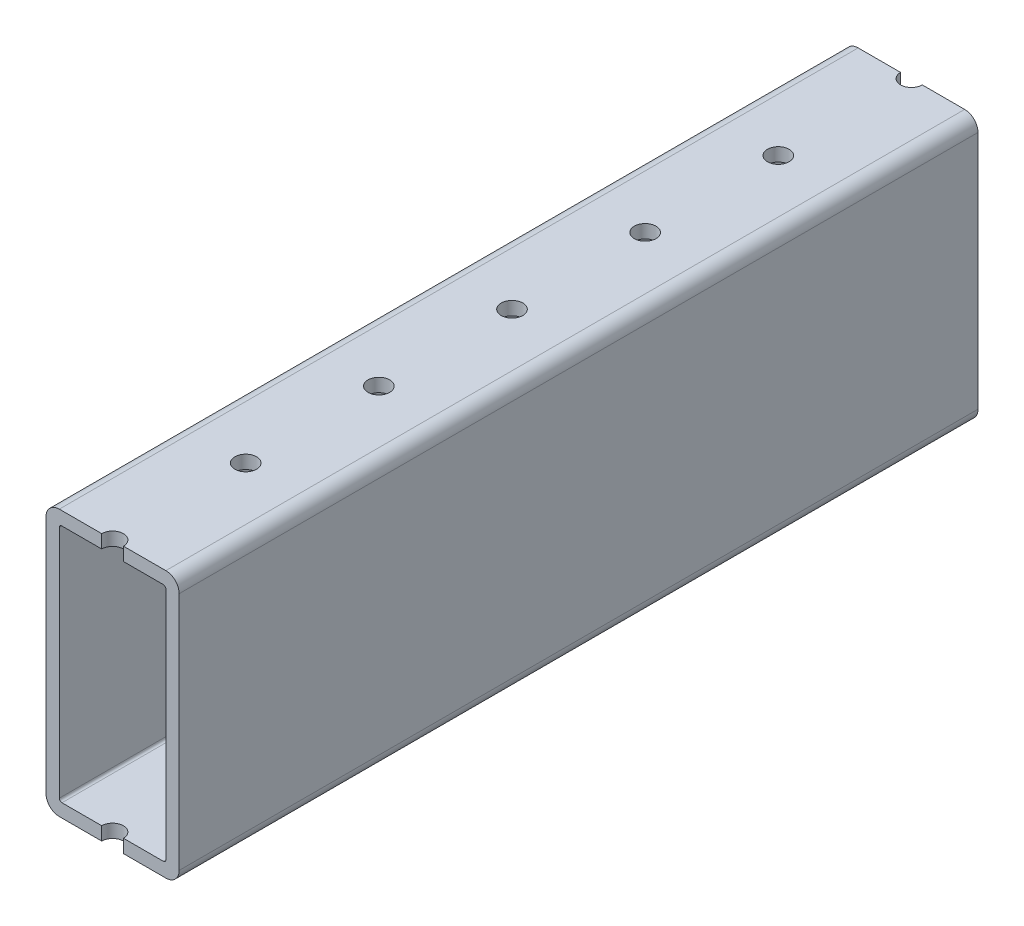
ISO-10303-21;
HEADER;
FILE_DESCRIPTION(('STEP AP214'),'2;1');
FILE_NAME('part.step','',(''),(''),'','','');
FILE_SCHEMA(('AUTOMOTIVE_DESIGN { 1 0 10303 214 1 1 1 1 }'));
ENDSEC;
DATA;
#1=APPLICATION_CONTEXT('core data for automotive mechanical design processes');
#2=APPLICATION_PROTOCOL_DEFINITION('international standard','automotive_design',2000,#1);
#3=PRODUCT_CONTEXT('',#1,'mechanical');
#4=PRODUCT('Part','Part','',(#3));
#5=PRODUCT_RELATED_PRODUCT_CATEGORY('part','',(#4));
#6=PRODUCT_DEFINITION_FORMATION('','',#4);
#7=PRODUCT_DEFINITION_CONTEXT('part definition',#1,'design');
#8=PRODUCT_DEFINITION('design','',#6,#7);
#9=PRODUCT_DEFINITION_SHAPE('','',#8);
#10=(LENGTH_UNIT() NAMED_UNIT(*) SI_UNIT(.MILLI.,.METRE.));
#11=(NAMED_UNIT(*) PLANE_ANGLE_UNIT() SI_UNIT($,.RADIAN.));
#12=(NAMED_UNIT(*) SI_UNIT($,.STERADIAN.) SOLID_ANGLE_UNIT());
#13=UNCERTAINTY_MEASURE_WITH_UNIT(LENGTH_MEASURE(1.E-05),#10,'distance_accuracy_value','');
#14=(GEOMETRIC_REPRESENTATION_CONTEXT(3) GLOBAL_UNCERTAINTY_ASSIGNED_CONTEXT((#13)) GLOBAL_UNIT_ASSIGNED_CONTEXT((#10,
#11,#12)) REPRESENTATION_CONTEXT('',''));
#15=CARTESIAN_POINT('',(0.,0.,0.));
#16=DIRECTION('',(0.,0.,1.));
#17=DIRECTION('',(1.,0.,0.));
#18=AXIS2_PLACEMENT_3D('',#15,#16,#17);
#19=CARTESIAN_POINT('',(-12.7,-25.4000000000001,-76.2));
#20=DIRECTION('',(0.,0.,-1.));
#21=DIRECTION('',(-1.,0.,0.));
#22=AXIS2_PLACEMENT_3D('',#19,#20,#21);
#23=PLANE('',#22);
#24=DIRECTION('',(1.,0.,0.));
#25=VECTOR('',#24,1.);
#26=CARTESIAN_POINT('',(-12.7,-25.4000000000001,-76.2));
#27=LINE('',#26,#25);
#28=CARTESIAN_POINT('',(-10.16,-25.4000000000001,-76.2));
#29=VERTEX_POINT('',#28);
#30=CARTESIAN_POINT('',(-2.07009999999996,-25.4000000000001,-76.2));
#31=VERTEX_POINT('',#30);
#32=EDGE_CURVE('E220',#29,#31,#27,.T.);
#33=ORIENTED_EDGE('',*,*,#32,.F.);
#34=CARTESIAN_POINT('',(-10.16,-22.86,-76.2));
#35=DIRECTION('',(0.,0.,-1.));
#36=DIRECTION('',(-1.,0.,0.));
#37=AXIS2_PLACEMENT_3D('',#34,#35,#36);
#38=CIRCLE('',#37,2.54);
#39=CARTESIAN_POINT('',(-12.7,-22.86,-76.2));
#40=VERTEX_POINT('',#39);
#41=EDGE_CURVE('E299',#29,#40,#38,.T.);
#42=ORIENTED_EDGE('',*,*,#41,.T.);
#43=DIRECTION('',(0.,1.,0.));
#44=VECTOR('',#43,1.);
#45=CARTESIAN_POINT('',(-12.7,-25.4000000000001,-76.2));
#46=LINE('',#45,#44);
#47=CARTESIAN_POINT('',(-12.7,22.86,-76.2));
#48=VERTEX_POINT('',#47);
#49=EDGE_CURVE('E306',#40,#48,#46,.T.);
#50=ORIENTED_EDGE('',*,*,#49,.T.);
#51=CARTESIAN_POINT('',(-10.16,22.86,-76.2));
#52=DIRECTION('',(0.,0.,-1.));
#53=DIRECTION('',(-1.,0.,0.));
#54=AXIS2_PLACEMENT_3D('',#51,#52,#53);
#55=CIRCLE('',#54,2.54);
#56=CARTESIAN_POINT('',(-10.16,25.4,-76.2));
#57=VERTEX_POINT('',#56);
#58=EDGE_CURVE('E297',#48,#57,#55,.T.);
#59=ORIENTED_EDGE('',*,*,#58,.T.);
#60=DIRECTION('',(1.,0.,0.));
#61=VECTOR('',#60,1.);
#62=CARTESIAN_POINT('',(-12.7,25.4,-76.2));
#63=LINE('',#62,#61);
#64=CARTESIAN_POINT('',(-2.07009999999996,25.4,-76.2));
#65=VERTEX_POINT('',#64);
#66=EDGE_CURVE('E219',#57,#65,#63,.T.);
#67=ORIENTED_EDGE('',*,*,#66,.T.);
#68=DIRECTION('',(0.,1.,0.));
#69=VECTOR('',#68,1.);
#70=CARTESIAN_POINT('',(-2.07009999999995,25.4,-76.2));
#71=LINE('',#70,#69);
#72=CARTESIAN_POINT('',(-2.07009999999995,22.86,-76.2));
#73=VERTEX_POINT('',#72);
#74=EDGE_CURVE('E200',#73,#65,#71,.T.);
#75=ORIENTED_EDGE('',*,*,#74,.F.);
#76=DIRECTION('',(1.,0.,0.));
#77=VECTOR('',#76,1.);
#78=CARTESIAN_POINT('',(-10.16,22.86,-76.2));
#79=LINE('',#78,#77);
#80=CARTESIAN_POINT('',(-9.66,22.86,-76.2));
#81=VERTEX_POINT('',#80);
#82=EDGE_CURVE('E387',#81,#73,#79,.T.);
#83=ORIENTED_EDGE('',*,*,#82,.F.);
#84=CARTESIAN_POINT('',(-9.66,22.36,-76.2));
#85=DIRECTION('',(0.,0.,-1.));
#86=DIRECTION('',(-1.,0.,0.));
#87=AXIS2_PLACEMENT_3D('',#84,#85,#86);
#88=CIRCLE('',#87,0.5);
#89=CARTESIAN_POINT('',(-10.16,22.3599999999999,-76.2));
#90=VERTEX_POINT('',#89);
#91=EDGE_CURVE('E266',#81,#90,#88,.F.);
#92=ORIENTED_EDGE('',*,*,#91,.T.);
#93=DIRECTION('',(0.,1.,0.));
#94=VECTOR('',#93,1.);
#95=CARTESIAN_POINT('',(-10.16,-22.86,-76.2));
#96=LINE('',#95,#94);
#97=CARTESIAN_POINT('',(-10.16,-22.36,-76.2));
#98=VERTEX_POINT('',#97);
#99=EDGE_CURVE('E384',#98,#90,#96,.T.);
#100=ORIENTED_EDGE('',*,*,#99,.F.);
#101=CARTESIAN_POINT('',(-9.66,-22.36,-76.2));
#102=DIRECTION('',(0.,0.,-1.));
#103=DIRECTION('',(-1.,0.,0.));
#104=AXIS2_PLACEMENT_3D('',#101,#102,#103);
#105=CIRCLE('',#104,0.5);
#106=CARTESIAN_POINT('',(-9.66,-22.86,-76.2));
#107=VERTEX_POINT('',#106);
#108=EDGE_CURVE('E262',#98,#107,#105,.F.);
#109=ORIENTED_EDGE('',*,*,#108,.T.);
#110=DIRECTION('',(-1.,0.,0.));
#111=VECTOR('',#110,1.);
#112=CARTESIAN_POINT('',(10.1600000000001,-22.86,-76.2));
#113=LINE('',#112,#111);
#114=CARTESIAN_POINT('',(-2.07009999999996,-22.86,-76.2));
#115=VERTEX_POINT('',#114);
#116=EDGE_CURVE('E360',#115,#107,#113,.T.);
#117=ORIENTED_EDGE('',*,*,#116,.F.);
#118=DIRECTION('',(0.,-1.,0.));
#119=VECTOR('',#118,1.);
#120=CARTESIAN_POINT('',(-2.07009999999996,-25.4000000000001,-76.2));
#121=LINE('',#120,#119);
#122=EDGE_CURVE('E430',#31,#115,#121,.F.);
#123=ORIENTED_EDGE('',*,*,#122,.F.);
#124=EDGE_LOOP('',(#33,#42,#50,#59,#67,#75,#83,#92,#100,#109,#117,#123));
#125=FACE_BOUND('',#124,.T.);
#126=ADVANCED_FACE('F33',(#125),#23,.T.);
#127=CARTESIAN_POINT('',(-12.7,25.4,76.2));
#128=DIRECTION('',(0.,0.,1.));
#129=DIRECTION('',(1.,0.,0.));
#130=AXIS2_PLACEMENT_3D('',#127,#128,#129);
#131=PLANE('',#130);
#132=DIRECTION('',(0.,-1.,0.));
#133=VECTOR('',#132,1.);
#134=CARTESIAN_POINT('',(12.7,25.4,76.2));
#135=LINE('',#134,#133);
#136=CARTESIAN_POINT('',(12.7,22.86,76.2));
#137=VERTEX_POINT('',#136);
#138=CARTESIAN_POINT('',(12.7,-22.86,76.2));
#139=VERTEX_POINT('',#138);
#140=EDGE_CURVE('E312',#137,#139,#135,.T.);
#141=ORIENTED_EDGE('',*,*,#140,.F.);
#142=CARTESIAN_POINT('',(10.16,22.86,76.2));
#143=DIRECTION('',(0.,0.,1.));
#144=DIRECTION('',(1.,0.,0.));
#145=AXIS2_PLACEMENT_3D('',#142,#143,#144);
#146=CIRCLE('',#145,2.54);
#147=CARTESIAN_POINT('',(10.16,25.4,76.2));
#148=VERTEX_POINT('',#147);
#149=EDGE_CURVE('E282',#137,#148,#146,.T.);
#150=ORIENTED_EDGE('',*,*,#149,.T.);
#151=DIRECTION('',(1.,0.,0.));
#152=VECTOR('',#151,1.);
#153=CARTESIAN_POINT('',(-12.7,25.4,76.2));
#154=LINE('',#153,#152);
#155=CARTESIAN_POINT('',(2.07009999999995,25.4,76.2));
#156=VERTEX_POINT('',#155);
#157=EDGE_CURVE('E222',#156,#148,#154,.T.);
#158=ORIENTED_EDGE('',*,*,#157,.F.);
#159=DIRECTION('',(0.,1.,0.));
#160=VECTOR('',#159,1.);
#161=CARTESIAN_POINT('',(2.07009999999995,25.4,76.2));
#162=LINE('',#161,#160);
#163=CARTESIAN_POINT('',(2.07009999999995,22.86,76.2));
#164=VERTEX_POINT('',#163);
#165=EDGE_CURVE('E420',#164,#156,#162,.T.);
#166=ORIENTED_EDGE('',*,*,#165,.F.);
#167=DIRECTION('',(1.,0.,0.));
#168=VECTOR('',#167,1.);
#169=CARTESIAN_POINT('',(-10.16,22.86,76.2));
#170=LINE('',#169,#168);
#171=CARTESIAN_POINT('',(9.66000000000006,22.86,76.2));
#172=VERTEX_POINT('',#171);
#173=EDGE_CURVE('E380',#164,#172,#170,.T.);
#174=ORIENTED_EDGE('',*,*,#173,.T.);
#175=CARTESIAN_POINT('',(9.66000000000006,22.36,76.2));
#176=DIRECTION('',(0.,0.,1.));
#177=DIRECTION('',(1.,0.,0.));
#178=AXIS2_PLACEMENT_3D('',#175,#176,#177);
#179=CIRCLE('',#178,0.5);
#180=CARTESIAN_POINT('',(10.1600000000001,22.36,76.2));
#181=VERTEX_POINT('',#180);
#182=EDGE_CURVE('E260',#172,#181,#179,.F.);
#183=ORIENTED_EDGE('',*,*,#182,.T.);
#184=DIRECTION('',(0.,-1.,0.));
#185=VECTOR('',#184,1.);
#186=CARTESIAN_POINT('',(10.1600000000001,22.86,76.2));
#187=LINE('',#186,#185);
#188=CARTESIAN_POINT('',(10.1600000000001,-22.36,76.2));
#189=VERTEX_POINT('',#188);
#190=EDGE_CURVE('E338',#181,#189,#187,.T.);
#191=ORIENTED_EDGE('',*,*,#190,.T.);
#192=CARTESIAN_POINT('',(9.66000000000006,-22.36,76.2));
#193=DIRECTION('',(0.,0.,1.));
#194=DIRECTION('',(1.,0.,0.));
#195=AXIS2_PLACEMENT_3D('',#192,#193,#194);
#196=CIRCLE('',#195,0.5);
#197=CARTESIAN_POINT('',(9.66000000000006,-22.86,76.2));
#198=VERTEX_POINT('',#197);
#199=EDGE_CURVE('E272',#189,#198,#196,.F.);
#200=ORIENTED_EDGE('',*,*,#199,.T.);
#201=DIRECTION('',(-1.,0.,0.));
#202=VECTOR('',#201,1.);
#203=CARTESIAN_POINT('',(10.1600000000001,-22.86,76.2));
#204=LINE('',#203,#202);
#205=CARTESIAN_POINT('',(2.07009999999995,-22.86,76.2));
#206=VERTEX_POINT('',#205);
#207=EDGE_CURVE('E374',#198,#206,#204,.T.);
#208=ORIENTED_EDGE('',*,*,#207,.T.);
#209=DIRECTION('',(0.,-1.,0.));
#210=VECTOR('',#209,1.);
#211=CARTESIAN_POINT('',(2.07009999999995,-25.4000000000001,76.2));
#212=LINE('',#211,#210);
#213=CARTESIAN_POINT('',(2.07009999999995,-25.4000000000001,76.2));
#214=VERTEX_POINT('',#213);
#215=EDGE_CURVE('E361',#214,#206,#212,.F.);
#216=ORIENTED_EDGE('',*,*,#215,.F.);
#217=DIRECTION('',(1.,0.,0.));
#218=VECTOR('',#217,1.);
#219=CARTESIAN_POINT('',(-12.7,-25.4000000000001,76.2));
#220=LINE('',#219,#218);
#221=CARTESIAN_POINT('',(10.16,-25.4000000000001,76.2));
#222=VERTEX_POINT('',#221);
#223=EDGE_CURVE('E321',#214,#222,#220,.T.);
#224=ORIENTED_EDGE('',*,*,#223,.T.);
#225=CARTESIAN_POINT('',(10.16,-22.86,76.2));
#226=DIRECTION('',(0.,0.,1.));
#227=DIRECTION('',(1.,0.,0.));
#228=AXIS2_PLACEMENT_3D('',#225,#226,#227);
#229=CIRCLE('',#228,2.54);
#230=EDGE_CURVE('E280',#222,#139,#229,.T.);
#231=ORIENTED_EDGE('',*,*,#230,.T.);
#232=EDGE_LOOP('',(#141,#150,#158,#166,#174,#183,#191,#200,#208,#216,#224,#231));
#233=FACE_BOUND('',#232,.T.);
#234=ADVANCED_FACE('F463',(#233),#131,.T.);
#235=CARTESIAN_POINT('',(-12.7,-25.4000000000001,76.2));
#236=DIRECTION('',(0.,-1.,0.));
#237=DIRECTION('',(0.,0.,-1.));
#238=AXIS2_PLACEMENT_3D('',#235,#236,#237);
#239=PLANE('',#238);
#240=CARTESIAN_POINT('',(-10.16,-25.4000000000001,76.2));
#241=VERTEX_POINT('',#240);
#242=CARTESIAN_POINT('',(-2.07009999999995,-25.4000000000001,76.2));
#243=VERTEX_POINT('',#242);
#244=EDGE_CURVE('E233',#241,#243,#220,.T.);
#245=ORIENTED_EDGE('',*,*,#244,.F.);
#246=DIRECTION('',(0.,0.,-1.));
#247=VECTOR('',#246,1.);
#248=CARTESIAN_POINT('',(-10.16,-25.4000000000001,-76.2));
#249=LINE('',#248,#247);
#250=EDGE_CURVE('E294',#241,#29,#249,.T.);
#251=ORIENTED_EDGE('',*,*,#250,.T.);
#252=ORIENTED_EDGE('',*,*,#32,.T.);
#253=CARTESIAN_POINT('',(0.,-25.4000000000001,-76.1999999999999));
#254=DIRECTION('',(0.,-1.,0.));
#255=DIRECTION('',(0.,0.,-1.));
#256=AXIS2_PLACEMENT_3D('',#253,#254,#255);
#257=CIRCLE('',#256,2.07009999999995);
#258=CARTESIAN_POINT('',(2.07009999999994,-25.4000000000001,-76.2));
#259=VERTEX_POINT('',#258);
#260=EDGE_CURVE('E422',#259,#31,#257,.T.);
#261=ORIENTED_EDGE('',*,*,#260,.F.);
#262=CARTESIAN_POINT('',(10.16,-25.4000000000001,-76.2));
#263=VERTEX_POINT('',#262);
#264=EDGE_CURVE('E223',#259,#263,#27,.T.);
#265=ORIENTED_EDGE('',*,*,#264,.T.);
#266=DIRECTION('',(0.,0.,-1.));
#267=VECTOR('',#266,1.);
#268=CARTESIAN_POINT('',(10.16,-25.4000000000001,76.2));
#269=LINE('',#268,#267);
#270=EDGE_CURVE('E292',#263,#222,#269,.F.);
#271=ORIENTED_EDGE('',*,*,#270,.T.);
#272=ORIENTED_EDGE('',*,*,#223,.F.);
#273=CARTESIAN_POINT('',(0.,-25.4000000000001,76.2));
#274=DIRECTION('',(0.,-1.,0.));
#275=DIRECTION('',(0.,0.,-1.));
#276=AXIS2_PLACEMENT_3D('',#273,#274,#275);
#277=CIRCLE('',#276,2.07009999999995);
#278=EDGE_CURVE('E358',#243,#214,#277,.T.);
#279=ORIENTED_EDGE('',*,*,#278,.F.);
#280=EDGE_LOOP('',(#245,#251,#252,#261,#265,#271,#272,#279));
#281=FACE_BOUND('',#280,.T.);
#282=CARTESIAN_POINT('',(0.,-25.4000000000001,-50.8));
#283=DIRECTION('',(0.,-1.,0.));
#284=DIRECTION('',(0.,0.,-1.));
#285=AXIS2_PLACEMENT_3D('',#282,#283,#284);
#286=CIRCLE('',#285,2.07009999999995);
#287=CARTESIAN_POINT('',(0.,-25.4000000000001,-52.8700999999999));
#288=VERTEX_POINT('',#287);
#289=EDGE_CURVE('E434',#288,#288,#286,.T.);
#290=ORIENTED_EDGE('',*,*,#289,.F.);
#291=EDGE_LOOP('',(#290));
#292=FACE_BOUND('',#291,.T.);
#293=CARTESIAN_POINT('',(0.,-25.4000000000001,-25.4));
#294=DIRECTION('',(0.,-1.,0.));
#295=DIRECTION('',(0.,0.,-1.));
#296=AXIS2_PLACEMENT_3D('',#293,#294,#295);
#297=CIRCLE('',#296,2.07009999999995);
#298=CARTESIAN_POINT('',(0.,-25.4000000000001,-27.4700999999999));
#299=VERTEX_POINT('',#298);
#300=EDGE_CURVE('E440',#299,#299,#297,.T.);
#301=ORIENTED_EDGE('',*,*,#300,.F.);
#302=EDGE_LOOP('',(#301));
#303=FACE_BOUND('',#302,.T.);
#304=CARTESIAN_POINT('',(0.,-25.4000000000001,0.));
#305=DIRECTION('',(0.,-1.,0.));
#306=DIRECTION('',(0.,0.,-1.));
#307=AXIS2_PLACEMENT_3D('',#304,#305,#306);
#308=CIRCLE('',#307,2.07009999999995);
#309=CARTESIAN_POINT('',(0.,-25.4000000000001,-2.07009999999995));
#310=VERTEX_POINT('',#309);
#311=EDGE_CURVE('E446',#310,#310,#308,.T.);
#312=ORIENTED_EDGE('',*,*,#311,.F.);
#313=EDGE_LOOP('',(#312));
#314=FACE_BOUND('',#313,.T.);
#315=CARTESIAN_POINT('',(0.,-25.4000000000001,25.4000000000001));
#316=DIRECTION('',(0.,-1.,0.));
#317=DIRECTION('',(0.,0.,-1.));
#318=AXIS2_PLACEMENT_3D('',#315,#316,#317);
#319=CIRCLE('',#318,2.07009999999995);
#320=CARTESIAN_POINT('',(0.,-25.4000000000001,23.3299000000001));
#321=VERTEX_POINT('',#320);
#322=EDGE_CURVE('E452',#321,#321,#319,.T.);
#323=ORIENTED_EDGE('',*,*,#322,.F.);
#324=EDGE_LOOP('',(#323));
#325=FACE_BOUND('',#324,.T.);
#326=CARTESIAN_POINT('',(0.,-25.4000000000001,50.8000000000001));
#327=DIRECTION('',(0.,-1.,0.));
#328=DIRECTION('',(0.,0.,-1.));
#329=AXIS2_PLACEMENT_3D('',#326,#327,#328);
#330=CIRCLE('',#329,2.07009999999995);
#331=CARTESIAN_POINT('',(0.,-25.4000000000001,48.7299000000001));
#332=VERTEX_POINT('',#331);
#333=EDGE_CURVE('E370',#332,#332,#330,.T.);
#334=ORIENTED_EDGE('',*,*,#333,.F.);
#335=EDGE_LOOP('',(#334));
#336=FACE_BOUND('',#335,.T.);
#337=ADVANCED_FACE('F364',(#281,#292,#303,#314,#325,#336),#239,.T.);
#338=DIRECTION('',(0.,-1.,0.));
#339=VECTOR('',#338,1.);
#340=CARTESIAN_POINT('',(-12.7,25.4,76.2));
#341=LINE('',#340,#339);
#342=CARTESIAN_POINT('',(-12.7,22.86,76.2));
#343=VERTEX_POINT('',#342);
#344=CARTESIAN_POINT('',(-12.7,-22.86,76.2));
#345=VERTEX_POINT('',#344);
#346=EDGE_CURVE('E307',#343,#345,#341,.T.);
#347=ORIENTED_EDGE('',*,*,#346,.T.);
#348=CARTESIAN_POINT('',(-10.16,-22.86,76.2));
#349=DIRECTION('',(0.,0.,1.));
#350=DIRECTION('',(1.,0.,0.));
#351=AXIS2_PLACEMENT_3D('',#348,#349,#350);
#352=CIRCLE('',#351,2.54);
#353=EDGE_CURVE('E11',#345,#241,#352,.T.);
#354=ORIENTED_EDGE('',*,*,#353,.T.);
#355=ORIENTED_EDGE('',*,*,#244,.T.);
#356=DIRECTION('',(0.,-1.,0.));
#357=VECTOR('',#356,1.);
#358=CARTESIAN_POINT('',(-2.07009999999996,-25.4000000000001,76.2));
#359=LINE('',#358,#357);
#360=CARTESIAN_POINT('',(-2.07009999999996,-22.86,76.2));
#361=VERTEX_POINT('',#360);
#362=EDGE_CURVE('E349',#361,#243,#359,.T.);
#363=ORIENTED_EDGE('',*,*,#362,.F.);
#364=CARTESIAN_POINT('',(-9.66,-22.86,76.2));
#365=VERTEX_POINT('',#364);
#366=EDGE_CURVE('E377',#361,#365,#204,.T.);
#367=ORIENTED_EDGE('',*,*,#366,.T.);
#368=CARTESIAN_POINT('',(-9.66,-22.36,76.2));
#369=DIRECTION('',(0.,0.,1.));
#370=DIRECTION('',(1.,0.,0.));
#371=AXIS2_PLACEMENT_3D('',#368,#369,#370);
#372=CIRCLE('',#371,0.5);
#373=CARTESIAN_POINT('',(-10.16,-22.36,76.2));
#374=VERTEX_POINT('',#373);
#375=EDGE_CURVE('E264',#365,#374,#372,.F.);
#376=ORIENTED_EDGE('',*,*,#375,.T.);
#377=DIRECTION('',(0.,1.,0.));
#378=VECTOR('',#377,1.);
#379=CARTESIAN_POINT('',(-10.16,-22.86,76.2));
#380=LINE('',#379,#378);
#381=CARTESIAN_POINT('',(-10.16,22.3599999999999,76.2));
#382=VERTEX_POINT('',#381);
#383=EDGE_CURVE('E376',#374,#382,#380,.T.);
#384=ORIENTED_EDGE('',*,*,#383,.T.);
#385=CARTESIAN_POINT('',(-9.66,22.36,76.2));
#386=DIRECTION('',(0.,0.,1.));
#387=DIRECTION('',(1.,0.,0.));
#388=AXIS2_PLACEMENT_3D('',#385,#386,#387);
#389=CIRCLE('',#388,0.5);
#390=CARTESIAN_POINT('',(-9.66,22.86,76.2));
#391=VERTEX_POINT('',#390);
#392=EDGE_CURVE('E268',#382,#391,#389,.F.);
#393=ORIENTED_EDGE('',*,*,#392,.T.);
#394=CARTESIAN_POINT('',(-2.07009999999995,22.86,76.2));
#395=VERTEX_POINT('',#394);
#396=EDGE_CURVE('E342',#391,#395,#170,.T.);
#397=ORIENTED_EDGE('',*,*,#396,.T.);
#398=DIRECTION('',(0.,1.,0.));
#399=VECTOR('',#398,1.);
#400=CARTESIAN_POINT('',(-2.07009999999995,25.4,76.2));
#401=LINE('',#400,#399);
#402=CARTESIAN_POINT('',(-2.07009999999995,25.4,76.2));
#403=VERTEX_POINT('',#402);
#404=EDGE_CURVE('E320',#403,#395,#401,.F.);
#405=ORIENTED_EDGE('',*,*,#404,.F.);
#406=CARTESIAN_POINT('',(-10.16,25.4,76.2));
#407=VERTEX_POINT('',#406);
#408=EDGE_CURVE('E226',#407,#403,#154,.T.);
#409=ORIENTED_EDGE('',*,*,#408,.F.);
#410=CARTESIAN_POINT('',(-10.16,22.86,76.2));
#411=DIRECTION('',(0.,0.,1.));
#412=DIRECTION('',(1.,0.,0.));
#413=AXIS2_PLACEMENT_3D('',#410,#411,#412);
#414=CIRCLE('',#413,2.54);
#415=EDGE_CURVE('E41',#407,#343,#414,.T.);
#416=ORIENTED_EDGE('',*,*,#415,.T.);
#417=EDGE_LOOP('',(#347,#354,#355,#363,#367,#376,#384,#393,#397,#405,#409,#416));
#418=FACE_BOUND('',#417,.T.);
#419=ADVANCED_FACE('F318',(#418),#131,.T.);
#420=CARTESIAN_POINT('',(-12.7,25.4,-76.2));
#421=DIRECTION('',(0.,1.,0.));
#422=DIRECTION('',(0.,0.,1.));
#423=AXIS2_PLACEMENT_3D('',#420,#421,#422);
#424=PLANE('',#423);
#425=ORIENTED_EDGE('',*,*,#157,.T.);
#426=DIRECTION('',(0.,0.,1.));
#427=VECTOR('',#426,1.);
#428=CARTESIAN_POINT('',(10.16,25.4,-76.2));
#429=LINE('',#428,#427);
#430=CARTESIAN_POINT('',(10.16,25.4,-76.2));
#431=VERTEX_POINT('',#430);
#432=EDGE_CURVE('E218',#148,#431,#429,.F.);
#433=ORIENTED_EDGE('',*,*,#432,.T.);
#434=CARTESIAN_POINT('',(2.07009999999995,25.4,-76.2));
#435=VERTEX_POINT('',#434);
#436=EDGE_CURVE('E209',#435,#431,#63,.T.);
#437=ORIENTED_EDGE('',*,*,#436,.F.);
#438=CARTESIAN_POINT('',(0.,25.4,-76.1999999999999));
#439=DIRECTION('',(0.,1.,0.));
#440=DIRECTION('',(0.,0.,1.));
#441=AXIS2_PLACEMENT_3D('',#438,#439,#440);
#442=CIRCLE('',#441,2.07009999999995);
#443=EDGE_CURVE('E193',#65,#435,#442,.T.);
#444=ORIENTED_EDGE('',*,*,#443,.F.);
#445=ORIENTED_EDGE('',*,*,#66,.F.);
#446=DIRECTION('',(0.,0.,1.));
#447=VECTOR('',#446,1.);
#448=CARTESIAN_POINT('',(-10.16,25.4,76.2));
#449=LINE('',#448,#447);
#450=EDGE_CURVE('E284',#57,#407,#449,.T.);
#451=ORIENTED_EDGE('',*,*,#450,.T.);
#452=ORIENTED_EDGE('',*,*,#408,.T.);
#453=CARTESIAN_POINT('',(0.,25.4,76.2));
#454=DIRECTION('',(0.,1.,0.));
#455=DIRECTION('',(0.,0.,1.));
#456=AXIS2_PLACEMENT_3D('',#453,#454,#455);
#457=CIRCLE('',#456,2.07009999999995);
#458=EDGE_CURVE('E324',#156,#403,#457,.T.);
#459=ORIENTED_EDGE('',*,*,#458,.F.);
#460=EDGE_LOOP('',(#425,#433,#437,#444,#445,#451,#452,#459));
#461=FACE_BOUND('',#460,.T.);
#462=CARTESIAN_POINT('',(0.,25.4,-50.8));
#463=DIRECTION('',(0.,1.,0.));
#464=DIRECTION('',(0.,0.,1.));
#465=AXIS2_PLACEMENT_3D('',#462,#463,#464);
#466=CIRCLE('',#465,2.07009999999995);
#467=CARTESIAN_POINT('',(0.,25.4,-48.7299));
#468=VERTEX_POINT('',#467);
#469=EDGE_CURVE('E591',#468,#468,#466,.T.);
#470=ORIENTED_EDGE('',*,*,#469,.F.);
#471=EDGE_LOOP('',(#470));
#472=FACE_BOUND('',#471,.T.);
#473=CARTESIAN_POINT('',(0.,25.4,-25.4));
#474=DIRECTION('',(0.,1.,0.));
#475=DIRECTION('',(0.,0.,1.));
#476=AXIS2_PLACEMENT_3D('',#473,#474,#475);
#477=CIRCLE('',#476,2.07009999999995);
#478=CARTESIAN_POINT('',(0.,25.4,-23.3299));
#479=VERTEX_POINT('',#478);
#480=EDGE_CURVE('E599',#479,#479,#477,.T.);
#481=ORIENTED_EDGE('',*,*,#480,.F.);
#482=EDGE_LOOP('',(#481));
#483=FACE_BOUND('',#482,.T.);
#484=CARTESIAN_POINT('',(0.,25.4,0.));
#485=DIRECTION('',(0.,1.,0.));
#486=DIRECTION('',(0.,0.,1.));
#487=AXIS2_PLACEMENT_3D('',#484,#485,#486);
#488=CIRCLE('',#487,2.07009999999995);
#489=CARTESIAN_POINT('',(0.,25.4,2.07009999999995));
#490=VERTEX_POINT('',#489);
#491=EDGE_CURVE('E605',#490,#490,#488,.T.);
#492=ORIENTED_EDGE('',*,*,#491,.F.);
#493=EDGE_LOOP('',(#492));
#494=FACE_BOUND('',#493,.T.);
#495=CARTESIAN_POINT('',(0.,25.4,25.4000000000001));
#496=DIRECTION('',(0.,1.,0.));
#497=DIRECTION('',(0.,0.,1.));
#498=AXIS2_PLACEMENT_3D('',#495,#496,#497);
#499=CIRCLE('',#498,2.07009999999995);
#500=CARTESIAN_POINT('',(0.,25.4,27.4701));
#501=VERTEX_POINT('',#500);
#502=EDGE_CURVE('E611',#501,#501,#499,.T.);
#503=ORIENTED_EDGE('',*,*,#502,.F.);
#504=EDGE_LOOP('',(#503));
#505=FACE_BOUND('',#504,.T.);
#506=CARTESIAN_POINT('',(0.,25.4,50.8000000000001));
#507=DIRECTION('',(0.,1.,0.));
#508=DIRECTION('',(0.,0.,1.));
#509=AXIS2_PLACEMENT_3D('',#506,#507,#508);
#510=CIRCLE('',#509,2.07009999999995);
#511=CARTESIAN_POINT('',(0.,25.4,52.8701));
#512=VERTEX_POINT('',#511);
#513=EDGE_CURVE('E617',#512,#512,#510,.T.);
#514=ORIENTED_EDGE('',*,*,#513,.F.);
#515=EDGE_LOOP('',(#514));
#516=FACE_BOUND('',#515,.T.);
#517=ADVANCED_FACE('F215',(#461,#472,#483,#494,#505,#516),#424,.T.);
#518=ORIENTED_EDGE('',*,*,#436,.T.);
#519=CARTESIAN_POINT('',(10.16,22.86,-76.2));
#520=DIRECTION('',(0.,0.,-1.));
#521=DIRECTION('',(-1.,0.,0.));
#522=AXIS2_PLACEMENT_3D('',#519,#520,#521);
#523=CIRCLE('',#522,2.54);
#524=CARTESIAN_POINT('',(12.7,22.86,-76.2));
#525=VERTEX_POINT('',#524);
#526=EDGE_CURVE('E290',#431,#525,#523,.T.);
#527=ORIENTED_EDGE('',*,*,#526,.T.);
#528=DIRECTION('',(0.,1.,0.));
#529=VECTOR('',#528,1.);
#530=CARTESIAN_POINT('',(12.7,-25.4000000000001,-76.2));
#531=LINE('',#530,#529);
#532=CARTESIAN_POINT('',(12.7,-22.86,-76.2));
#533=VERTEX_POINT('',#532);
#534=EDGE_CURVE('E332',#533,#525,#531,.T.);
#535=ORIENTED_EDGE('',*,*,#534,.F.);
#536=CARTESIAN_POINT('',(10.16,-22.86,-76.2));
#537=DIRECTION('',(0.,0.,-1.));
#538=DIRECTION('',(-1.,0.,0.));
#539=AXIS2_PLACEMENT_3D('',#536,#537,#538);
#540=CIRCLE('',#539,2.54);
#541=EDGE_CURVE('E288',#533,#263,#540,.T.);
#542=ORIENTED_EDGE('',*,*,#541,.T.);
#543=ORIENTED_EDGE('',*,*,#264,.F.);
#544=DIRECTION('',(0.,-1.,0.));
#545=VECTOR('',#544,1.);
#546=CARTESIAN_POINT('',(2.07009999999995,-25.4000000000001,-76.2));
#547=LINE('',#546,#545);
#548=CARTESIAN_POINT('',(2.07009999999995,-22.86,-76.2));
#549=VERTEX_POINT('',#548);
#550=EDGE_CURVE('E432',#549,#259,#547,.T.);
#551=ORIENTED_EDGE('',*,*,#550,.F.);
#552=CARTESIAN_POINT('',(9.66000000000006,-22.86,-76.2));
#553=VERTEX_POINT('',#552);
#554=EDGE_CURVE('E382',#553,#549,#113,.T.);
#555=ORIENTED_EDGE('',*,*,#554,.F.);
#556=CARTESIAN_POINT('',(9.66000000000006,-22.36,-76.2));
#557=DIRECTION('',(0.,0.,-1.));
#558=DIRECTION('',(-1.,0.,0.));
#559=AXIS2_PLACEMENT_3D('',#556,#557,#558);
#560=CIRCLE('',#559,0.5);
#561=CARTESIAN_POINT('',(10.1600000000001,-22.36,-76.2));
#562=VERTEX_POINT('',#561);
#563=EDGE_CURVE('E270',#553,#562,#560,.F.);
#564=ORIENTED_EDGE('',*,*,#563,.T.);
#565=DIRECTION('',(0.,-1.,0.));
#566=VECTOR('',#565,1.);
#567=CARTESIAN_POINT('',(10.1600000000001,22.86,-76.2));
#568=LINE('',#567,#566);
#569=CARTESIAN_POINT('',(10.1600000000001,22.36,-76.2));
#570=VERTEX_POINT('',#569);
#571=EDGE_CURVE('E389',#570,#562,#568,.T.);
#572=ORIENTED_EDGE('',*,*,#571,.F.);
#573=CARTESIAN_POINT('',(9.66000000000006,22.36,-76.2));
#574=DIRECTION('',(0.,0.,-1.));
#575=DIRECTION('',(-1.,0.,0.));
#576=AXIS2_PLACEMENT_3D('',#573,#574,#575);
#577=CIRCLE('',#576,0.5);
#578=CARTESIAN_POINT('',(9.66000000000006,22.86,-76.2));
#579=VERTEX_POINT('',#578);
#580=EDGE_CURVE('E258',#570,#579,#577,.F.);
#581=ORIENTED_EDGE('',*,*,#580,.T.);
#582=CARTESIAN_POINT('',(2.07009999999994,22.86,-76.2));
#583=VERTEX_POINT('',#582);
#584=EDGE_CURVE('E212',#583,#579,#79,.T.);
#585=ORIENTED_EDGE('',*,*,#584,.F.);
#586=DIRECTION('',(0.,1.,0.));
#587=VECTOR('',#586,1.);
#588=CARTESIAN_POINT('',(2.07009999999994,25.4,-76.2));
#589=LINE('',#588,#587);
#590=EDGE_CURVE('E197',#435,#583,#589,.F.);
#591=ORIENTED_EDGE('',*,*,#590,.F.);
#592=EDGE_LOOP('',(#518,#527,#535,#542,#543,#551,#555,#564,#572,#581,#585,#591));
#593=FACE_BOUND('',#592,.T.);
#594=ADVANCED_FACE('F208',(#593),#23,.T.);
#595=CARTESIAN_POINT('',(-12.7,0.,0.));
#596=DIRECTION('',(1.,0.,0.));
#597=DIRECTION('',(0.,0.,-1.));
#598=AXIS2_PLACEMENT_3D('',#595,#596,#597);
#599=PLANE('',#598);
#600=ORIENTED_EDGE('',*,*,#49,.F.);
#601=DIRECTION('',(0.,0.,-1.));
#602=VECTOR('',#601,1.);
#603=CARTESIAN_POINT('',(-12.7,-22.86,76.2));
#604=LINE('',#603,#602);
#605=EDGE_CURVE('E48',#40,#345,#604,.F.);
#606=ORIENTED_EDGE('',*,*,#605,.T.);
#607=ORIENTED_EDGE('',*,*,#346,.F.);
#608=DIRECTION('',(0.,0.,1.));
#609=VECTOR('',#608,1.);
#610=CARTESIAN_POINT('',(-12.7,22.86,-76.2));
#611=LINE('',#610,#609);
#612=EDGE_CURVE('E301',#343,#48,#611,.F.);
#613=ORIENTED_EDGE('',*,*,#612,.T.);
#614=EDGE_LOOP('',(#600,#606,#607,#613));
#615=FACE_BOUND('',#614,.T.);
#616=ADVANCED_FACE('F305',(#615),#599,.F.);
#617=CARTESIAN_POINT('',(12.7,0.,0.));
#618=DIRECTION('',(1.,0.,0.));
#619=DIRECTION('',(0.,0.,-1.));
#620=AXIS2_PLACEMENT_3D('',#617,#618,#619);
#621=PLANE('',#620);
#622=ORIENTED_EDGE('',*,*,#534,.T.);
#623=DIRECTION('',(0.,0.,1.));
#624=VECTOR('',#623,1.);
#625=CARTESIAN_POINT('',(12.7,22.86,0.));
#626=LINE('',#625,#624);
#627=EDGE_CURVE('E277',#525,#137,#626,.T.);
#628=ORIENTED_EDGE('',*,*,#627,.T.);
#629=ORIENTED_EDGE('',*,*,#140,.T.);
#630=DIRECTION('',(0.,0.,-1.));
#631=VECTOR('',#630,1.);
#632=CARTESIAN_POINT('',(12.7,-22.86,0.));
#633=LINE('',#632,#631);
#634=EDGE_CURVE('E274',#139,#533,#633,.T.);
#635=ORIENTED_EDGE('',*,*,#634,.T.);
#636=EDGE_LOOP('',(#622,#628,#629,#635));
#637=FACE_BOUND('',#636,.T.);
#638=ADVANCED_FACE('F334',(#637),#621,.T.);
#639=CARTESIAN_POINT('',(10.1600000000001,-22.86,76.2));
#640=DIRECTION('',(0.,-1.,0.));
#641=DIRECTION('',(0.,0.,-1.));
#642=AXIS2_PLACEMENT_3D('',#639,#640,#641);
#643=PLANE('',#642);
#644=CARTESIAN_POINT('',(0.,-22.86,-50.8));
#645=DIRECTION('',(0.,-1.,0.));
#646=DIRECTION('',(0.,0.,-1.));
#647=AXIS2_PLACEMENT_3D('',#644,#645,#646);
#648=CIRCLE('',#647,2.07009999999995);
#649=CARTESIAN_POINT('',(0.,-22.86,-52.8700999999999));
#650=VERTEX_POINT('',#649);
#651=EDGE_CURVE('E437',#650,#650,#648,.T.);
#652=ORIENTED_EDGE('',*,*,#651,.T.);
#653=EDGE_LOOP('',(#652));
#654=FACE_BOUND('',#653,.T.);
#655=CARTESIAN_POINT('',(0.,-22.86,-25.4));
#656=DIRECTION('',(0.,-1.,0.));
#657=DIRECTION('',(0.,0.,-1.));
#658=AXIS2_PLACEMENT_3D('',#655,#656,#657);
#659=CIRCLE('',#658,2.07009999999995);
#660=CARTESIAN_POINT('',(0.,-22.86,-27.4700999999999));
#661=VERTEX_POINT('',#660);
#662=EDGE_CURVE('E443',#661,#661,#659,.T.);
#663=ORIENTED_EDGE('',*,*,#662,.T.);
#664=EDGE_LOOP('',(#663));
#665=FACE_BOUND('',#664,.T.);
#666=CARTESIAN_POINT('',(0.,-22.86,0.));
#667=DIRECTION('',(0.,-1.,0.));
#668=DIRECTION('',(0.,0.,-1.));
#669=AXIS2_PLACEMENT_3D('',#666,#667,#668);
#670=CIRCLE('',#669,2.07009999999995);
#671=CARTESIAN_POINT('',(0.,-22.86,-2.07009999999995));
#672=VERTEX_POINT('',#671);
#673=EDGE_CURVE('E449',#672,#672,#670,.T.);
#674=ORIENTED_EDGE('',*,*,#673,.T.);
#675=EDGE_LOOP('',(#674));
#676=FACE_BOUND('',#675,.T.);
#677=CARTESIAN_POINT('',(0.,-22.86,25.4000000000001));
#678=DIRECTION('',(0.,-1.,0.));
#679=DIRECTION('',(0.,0.,-1.));
#680=AXIS2_PLACEMENT_3D('',#677,#678,#679);
#681=CIRCLE('',#680,2.07009999999995);
#682=CARTESIAN_POINT('',(0.,-22.86,23.3299000000001));
#683=VERTEX_POINT('',#682);
#684=EDGE_CURVE('E455',#683,#683,#681,.T.);
#685=ORIENTED_EDGE('',*,*,#684,.T.);
#686=EDGE_LOOP('',(#685));
#687=FACE_BOUND('',#686,.T.);
#688=CARTESIAN_POINT('',(0.,-22.86,50.8000000000001));
#689=DIRECTION('',(0.,-1.,0.));
#690=DIRECTION('',(0.,0.,-1.));
#691=AXIS2_PLACEMENT_3D('',#688,#689,#690);
#692=CIRCLE('',#691,2.07009999999995);
#693=CARTESIAN_POINT('',(0.,-22.86,48.7299000000001));
#694=VERTEX_POINT('',#693);
#695=EDGE_CURVE('E366',#694,#694,#692,.T.);
#696=ORIENTED_EDGE('',*,*,#695,.T.);
#697=EDGE_LOOP('',(#696));
#698=FACE_BOUND('',#697,.T.);
#699=ORIENTED_EDGE('',*,*,#116,.T.);
#700=DIRECTION('',(0.,0.,-1.));
#701=VECTOR('',#700,1.);
#702=CARTESIAN_POINT('',(-9.66,-22.86,76.2));
#703=LINE('',#702,#701);
#704=EDGE_CURVE('E256',#107,#365,#703,.F.);
#705=ORIENTED_EDGE('',*,*,#704,.T.);
#706=ORIENTED_EDGE('',*,*,#366,.F.);
#707=CARTESIAN_POINT('',(0.,-22.86,76.2));
#708=DIRECTION('',(0.,-1.,0.));
#709=DIRECTION('',(0.,0.,-1.));
#710=AXIS2_PLACEMENT_3D('',#707,#708,#709);
#711=CIRCLE('',#710,2.07009999999995);
#712=EDGE_CURVE('E229',#361,#206,#711,.T.);
#713=ORIENTED_EDGE('',*,*,#712,.T.);
#714=ORIENTED_EDGE('',*,*,#207,.F.);
#715=DIRECTION('',(0.,0.,-1.));
#716=VECTOR('',#715,1.);
#717=CARTESIAN_POINT('',(9.66000000000006,-22.86,-76.2));
#718=LINE('',#717,#716);
#719=EDGE_CURVE('E253',#198,#553,#718,.T.);
#720=ORIENTED_EDGE('',*,*,#719,.T.);
#721=ORIENTED_EDGE('',*,*,#554,.T.);
#722=CARTESIAN_POINT('',(0.,-22.86,-76.1999999999999));
#723=DIRECTION('',(0.,-1.,0.));
#724=DIRECTION('',(0.,0.,-1.));
#725=AXIS2_PLACEMENT_3D('',#722,#723,#724);
#726=CIRCLE('',#725,2.07009999999995);
#727=EDGE_CURVE('E232',#549,#115,#726,.T.);
#728=ORIENTED_EDGE('',*,*,#727,.T.);
#729=EDGE_LOOP('',(#699,#705,#706,#713,#714,#720,#721,#728));
#730=FACE_BOUND('',#729,.T.);
#731=ADVANCED_FACE('F486',(#654,#665,#676,#687,#698,#730),#643,.F.);
#732=CARTESIAN_POINT('',(10.1600000000001,22.86,76.2));
#733=DIRECTION('',(1.,0.,0.));
#734=DIRECTION('',(0.,0.,-1.));
#735=AXIS2_PLACEMENT_3D('',#732,#733,#734);
#736=PLANE('',#735);
#737=ORIENTED_EDGE('',*,*,#190,.F.);
#738=DIRECTION('',(0.,0.,-1.));
#739=VECTOR('',#738,1.);
#740=CARTESIAN_POINT('',(10.1600000000001,22.36,-76.2));
#741=LINE('',#740,#739);
#742=EDGE_CURVE('E240',#181,#570,#741,.T.);
#743=ORIENTED_EDGE('',*,*,#742,.T.);
#744=ORIENTED_EDGE('',*,*,#571,.T.);
#745=DIRECTION('',(0.,0.,-1.));
#746=VECTOR('',#745,1.);
#747=CARTESIAN_POINT('',(10.1600000000001,-22.36,76.2));
#748=LINE('',#747,#746);
#749=EDGE_CURVE('E238',#562,#189,#748,.F.);
#750=ORIENTED_EDGE('',*,*,#749,.T.);
#751=EDGE_LOOP('',(#737,#743,#744,#750));
#752=FACE_BOUND('',#751,.T.);
#753=ADVANCED_FACE('F490',(#752),#736,.F.);
#754=CARTESIAN_POINT('',(-10.16,22.86,76.2));
#755=DIRECTION('',(0.,1.,0.));
#756=DIRECTION('',(0.,0.,1.));
#757=AXIS2_PLACEMENT_3D('',#754,#755,#756);
#758=PLANE('',#757);
#759=CARTESIAN_POINT('',(0.,22.86,-50.8));
#760=DIRECTION('',(0.,1.,0.));
#761=DIRECTION('',(0.,0.,1.));
#762=AXIS2_PLACEMENT_3D('',#759,#760,#761);
#763=CIRCLE('',#762,2.07009999999995);
#764=CARTESIAN_POINT('',(0.,22.86,-48.7299));
#765=VERTEX_POINT('',#764);
#766=EDGE_CURVE('E594',#765,#765,#763,.T.);
#767=ORIENTED_EDGE('',*,*,#766,.T.);
#768=EDGE_LOOP('',(#767));
#769=FACE_BOUND('',#768,.T.);
#770=CARTESIAN_POINT('',(0.,22.86,-25.4));
#771=DIRECTION('',(0.,1.,0.));
#772=DIRECTION('',(0.,0.,1.));
#773=AXIS2_PLACEMENT_3D('',#770,#771,#772);
#774=CIRCLE('',#773,2.07009999999995);
#775=CARTESIAN_POINT('',(0.,22.86,-23.3299));
#776=VERTEX_POINT('',#775);
#777=EDGE_CURVE('E602',#776,#776,#774,.T.);
#778=ORIENTED_EDGE('',*,*,#777,.T.);
#779=EDGE_LOOP('',(#778));
#780=FACE_BOUND('',#779,.T.);
#781=CARTESIAN_POINT('',(0.,22.86,0.));
#782=DIRECTION('',(0.,1.,0.));
#783=DIRECTION('',(0.,0.,1.));
#784=AXIS2_PLACEMENT_3D('',#781,#782,#783);
#785=CIRCLE('',#784,2.07009999999995);
#786=CARTESIAN_POINT('',(0.,22.86,2.07009999999995));
#787=VERTEX_POINT('',#786);
#788=EDGE_CURVE('E608',#787,#787,#785,.T.);
#789=ORIENTED_EDGE('',*,*,#788,.T.);
#790=EDGE_LOOP('',(#789));
#791=FACE_BOUND('',#790,.T.);
#792=CARTESIAN_POINT('',(0.,22.86,25.4000000000001));
#793=DIRECTION('',(0.,1.,0.));
#794=DIRECTION('',(0.,0.,1.));
#795=AXIS2_PLACEMENT_3D('',#792,#793,#794);
#796=CIRCLE('',#795,2.07009999999995);
#797=CARTESIAN_POINT('',(0.,22.86,27.4701));
#798=VERTEX_POINT('',#797);
#799=EDGE_CURVE('E614',#798,#798,#796,.T.);
#800=ORIENTED_EDGE('',*,*,#799,.T.);
#801=EDGE_LOOP('',(#800));
#802=FACE_BOUND('',#801,.T.);
#803=CARTESIAN_POINT('',(0.,22.86,50.8000000000001));
#804=DIRECTION('',(0.,1.,0.));
#805=DIRECTION('',(0.,0.,1.));
#806=AXIS2_PLACEMENT_3D('',#803,#804,#805);
#807=CIRCLE('',#806,2.07009999999995);
#808=CARTESIAN_POINT('',(0.,22.86,52.8701));
#809=VERTEX_POINT('',#808);
#810=EDGE_CURVE('E619',#809,#809,#807,.T.);
#811=ORIENTED_EDGE('',*,*,#810,.T.);
#812=EDGE_LOOP('',(#811));
#813=FACE_BOUND('',#812,.T.);
#814=ORIENTED_EDGE('',*,*,#584,.T.);
#815=DIRECTION('',(0.,0.,-1.));
#816=VECTOR('',#815,1.);
#817=CARTESIAN_POINT('',(9.66000000000006,22.86,76.2));
#818=LINE('',#817,#816);
#819=EDGE_CURVE('E246',#579,#172,#818,.F.);
#820=ORIENTED_EDGE('',*,*,#819,.T.);
#821=ORIENTED_EDGE('',*,*,#173,.F.);
#822=CARTESIAN_POINT('',(0.,22.86,76.2));
#823=DIRECTION('',(0.,1.,0.));
#824=DIRECTION('',(0.,0.,1.));
#825=AXIS2_PLACEMENT_3D('',#822,#823,#824);
#826=CIRCLE('',#825,2.07009999999995);
#827=EDGE_CURVE('E417',#164,#395,#826,.T.);
#828=ORIENTED_EDGE('',*,*,#827,.T.);
#829=ORIENTED_EDGE('',*,*,#396,.F.);
#830=DIRECTION('',(0.,0.,-1.));
#831=VECTOR('',#830,1.);
#832=CARTESIAN_POINT('',(-9.66,22.86,-76.2));
#833=LINE('',#832,#831);
#834=EDGE_CURVE('E243',#391,#81,#833,.T.);
#835=ORIENTED_EDGE('',*,*,#834,.T.);
#836=ORIENTED_EDGE('',*,*,#82,.T.);
#837=CARTESIAN_POINT('',(0.,22.86,-76.1999999999999));
#838=DIRECTION('',(0.,1.,0.));
#839=DIRECTION('',(0.,0.,1.));
#840=AXIS2_PLACEMENT_3D('',#837,#838,#839);
#841=CIRCLE('',#840,2.07009999999995);
#842=EDGE_CURVE('E236',#73,#583,#841,.T.);
#843=ORIENTED_EDGE('',*,*,#842,.T.);
#844=EDGE_LOOP('',(#814,#820,#821,#828,#829,#835,#836,#843));
#845=FACE_BOUND('',#844,.T.);
#846=ADVANCED_FACE('F414',(#769,#780,#791,#802,#813,#845),#758,.F.);
#847=CARTESIAN_POINT('',(-10.16,-22.86,76.2));
#848=DIRECTION('',(-1.,0.,0.));
#849=DIRECTION('',(0.,0.,1.));
#850=AXIS2_PLACEMENT_3D('',#847,#848,#849);
#851=PLANE('',#850);
#852=ORIENTED_EDGE('',*,*,#383,.F.);
#853=DIRECTION('',(0.,0.,-1.));
#854=VECTOR('',#853,1.);
#855=CARTESIAN_POINT('',(-10.16,-22.36,-76.2));
#856=LINE('',#855,#854);
#857=EDGE_CURVE('E250',#374,#98,#856,.T.);
#858=ORIENTED_EDGE('',*,*,#857,.T.);
#859=ORIENTED_EDGE('',*,*,#99,.T.);
#860=DIRECTION('',(0.,0.,-1.));
#861=VECTOR('',#860,1.);
#862=CARTESIAN_POINT('',(-10.16,22.36,76.2));
#863=LINE('',#862,#861);
#864=EDGE_CURVE('E248',#90,#382,#863,.F.);
#865=ORIENTED_EDGE('',*,*,#864,.T.);
#866=EDGE_LOOP('',(#852,#858,#859,#865));
#867=FACE_BOUND('',#866,.T.);
#868=ADVANCED_FACE('F403',(#867),#851,.F.);
#869=CARTESIAN_POINT('',(0.,-25.4000000000001,76.2));
#870=DIRECTION('',(0.,-1.,0.));
#871=DIRECTION('',(0.,0.,-1.));
#872=AXIS2_PLACEMENT_3D('',#869,#870,#871);
#873=CYLINDRICAL_SURFACE('',#872,2.07009999999995);
#874=ORIENTED_EDGE('',*,*,#362,.T.);
#875=ORIENTED_EDGE('',*,*,#278,.T.);
#876=ORIENTED_EDGE('',*,*,#215,.T.);
#877=ORIENTED_EDGE('',*,*,#712,.F.);
#878=EDGE_LOOP('',(#874,#875,#876,#877));
#879=FACE_BOUND('',#878,.T.);
#880=ADVANCED_FACE('F356',(#879),#873,.F.);
#881=CARTESIAN_POINT('',(0.,-25.4000000000001,50.8000000000001));
#882=DIRECTION('',(0.,-1.,0.));
#883=DIRECTION('',(0.,0.,-1.));
#884=AXIS2_PLACEMENT_3D('',#881,#882,#883);
#885=CYLINDRICAL_SURFACE('',#884,2.07009999999995);
#886=ORIENTED_EDGE('',*,*,#695,.F.);
#887=EDGE_LOOP('',(#886));
#888=FACE_BOUND('',#887,.T.);
#889=ORIENTED_EDGE('',*,*,#333,.T.);
#890=EDGE_LOOP('',(#889));
#891=FACE_BOUND('',#890,.T.);
#892=ADVANCED_FACE('F460',(#888,#891),#885,.F.);
#893=CARTESIAN_POINT('',(0.,-25.4000000000001,25.4000000000001));
#894=DIRECTION('',(0.,-1.,0.));
#895=DIRECTION('',(0.,0.,-1.));
#896=AXIS2_PLACEMENT_3D('',#893,#894,#895);
#897=CYLINDRICAL_SURFACE('',#896,2.07009999999995);
#898=ORIENTED_EDGE('',*,*,#684,.F.);
#899=EDGE_LOOP('',(#898));
#900=FACE_BOUND('',#899,.T.);
#901=ORIENTED_EDGE('',*,*,#322,.T.);
#902=EDGE_LOOP('',(#901));
#903=FACE_BOUND('',#902,.T.);
#904=ADVANCED_FACE('F503',(#900,#903),#897,.F.);
#905=CARTESIAN_POINT('',(0.,-25.4000000000001,0.));
#906=DIRECTION('',(0.,-1.,0.));
#907=DIRECTION('',(0.,0.,-1.));
#908=AXIS2_PLACEMENT_3D('',#905,#906,#907);
#909=CYLINDRICAL_SURFACE('',#908,2.07009999999995);
#910=ORIENTED_EDGE('',*,*,#673,.F.);
#911=EDGE_LOOP('',(#910));
#912=FACE_BOUND('',#911,.T.);
#913=ORIENTED_EDGE('',*,*,#311,.T.);
#914=EDGE_LOOP('',(#913));
#915=FACE_BOUND('',#914,.T.);
#916=ADVANCED_FACE('F507',(#912,#915),#909,.F.);
#917=CARTESIAN_POINT('',(0.,-25.4000000000001,-25.4));
#918=DIRECTION('',(0.,-1.,0.));
#919=DIRECTION('',(0.,0.,-1.));
#920=AXIS2_PLACEMENT_3D('',#917,#918,#919);
#921=CYLINDRICAL_SURFACE('',#920,2.07009999999995);
#922=ORIENTED_EDGE('',*,*,#662,.F.);
#923=EDGE_LOOP('',(#922));
#924=FACE_BOUND('',#923,.T.);
#925=ORIENTED_EDGE('',*,*,#300,.T.);
#926=EDGE_LOOP('',(#925));
#927=FACE_BOUND('',#926,.T.);
#928=ADVANCED_FACE('F511',(#924,#927),#921,.F.);
#929=CARTESIAN_POINT('',(0.,-25.4000000000001,-50.8));
#930=DIRECTION('',(0.,-1.,0.));
#931=DIRECTION('',(0.,0.,-1.));
#932=AXIS2_PLACEMENT_3D('',#929,#930,#931);
#933=CYLINDRICAL_SURFACE('',#932,2.07009999999995);
#934=ORIENTED_EDGE('',*,*,#651,.F.);
#935=EDGE_LOOP('',(#934));
#936=FACE_BOUND('',#935,.T.);
#937=ORIENTED_EDGE('',*,*,#289,.T.);
#938=EDGE_LOOP('',(#937));
#939=FACE_BOUND('',#938,.T.);
#940=ADVANCED_FACE('F515',(#936,#939),#933,.F.);
#941=CARTESIAN_POINT('',(0.,-25.4000000000001,-76.1999999999999));
#942=DIRECTION('',(0.,-1.,0.));
#943=DIRECTION('',(0.,0.,-1.));
#944=AXIS2_PLACEMENT_3D('',#941,#942,#943);
#945=CYLINDRICAL_SURFACE('',#944,2.07009999999995);
#946=ORIENTED_EDGE('',*,*,#550,.T.);
#947=ORIENTED_EDGE('',*,*,#260,.T.);
#948=ORIENTED_EDGE('',*,*,#122,.T.);
#949=ORIENTED_EDGE('',*,*,#727,.F.);
#950=EDGE_LOOP('',(#946,#947,#948,#949));
#951=FACE_BOUND('',#950,.T.);
#952=ADVANCED_FACE('F519',(#951),#945,.F.);
#953=CARTESIAN_POINT('',(0.,25.4,76.2));
#954=DIRECTION('',(0.,1.,0.));
#955=DIRECTION('',(0.,0.,1.));
#956=AXIS2_PLACEMENT_3D('',#953,#954,#955);
#957=CYLINDRICAL_SURFACE('',#956,2.07009999999995);
#958=ORIENTED_EDGE('',*,*,#165,.T.);
#959=ORIENTED_EDGE('',*,*,#458,.T.);
#960=ORIENTED_EDGE('',*,*,#404,.T.);
#961=ORIENTED_EDGE('',*,*,#827,.F.);
#962=EDGE_LOOP('',(#958,#959,#960,#961));
#963=FACE_BOUND('',#962,.T.);
#964=ADVANCED_FACE('F419',(#963),#957,.F.);
#965=CARTESIAN_POINT('',(0.,25.4,50.8000000000001));
#966=DIRECTION('',(0.,1.,0.));
#967=DIRECTION('',(0.,0.,1.));
#968=AXIS2_PLACEMENT_3D('',#965,#966,#967);
#969=CYLINDRICAL_SURFACE('',#968,2.07009999999995);
#970=ORIENTED_EDGE('',*,*,#513,.T.);
#971=EDGE_LOOP('',(#970));
#972=FACE_BOUND('',#971,.T.);
#973=ORIENTED_EDGE('',*,*,#810,.F.);
#974=EDGE_LOOP('',(#973));
#975=FACE_BOUND('',#974,.T.);
#976=ADVANCED_FACE('F526',(#972,#975),#969,.F.);
#977=CARTESIAN_POINT('',(0.,25.4,25.4000000000001));
#978=DIRECTION('',(0.,1.,0.));
#979=DIRECTION('',(0.,0.,1.));
#980=AXIS2_PLACEMENT_3D('',#977,#978,#979);
#981=CYLINDRICAL_SURFACE('',#980,2.07009999999995);
#982=ORIENTED_EDGE('',*,*,#502,.T.);
#983=EDGE_LOOP('',(#982));
#984=FACE_BOUND('',#983,.T.);
#985=ORIENTED_EDGE('',*,*,#799,.F.);
#986=EDGE_LOOP('',(#985));
#987=FACE_BOUND('',#986,.T.);
#988=ADVANCED_FACE('F529',(#984,#987),#981,.F.);
#989=CARTESIAN_POINT('',(0.,25.4,0.));
#990=DIRECTION('',(0.,1.,0.));
#991=DIRECTION('',(0.,0.,1.));
#992=AXIS2_PLACEMENT_3D('',#989,#990,#991);
#993=CYLINDRICAL_SURFACE('',#992,2.07009999999995);
#994=ORIENTED_EDGE('',*,*,#491,.T.);
#995=EDGE_LOOP('',(#994));
#996=FACE_BOUND('',#995,.T.);
#997=ORIENTED_EDGE('',*,*,#788,.F.);
#998=EDGE_LOOP('',(#997));
#999=FACE_BOUND('',#998,.T.);
#1000=ADVANCED_FACE('F533',(#996,#999),#993,.F.);
#1001=CARTESIAN_POINT('',(0.,25.4,-25.4));
#1002=DIRECTION('',(0.,1.,0.));
#1003=DIRECTION('',(0.,0.,1.));
#1004=AXIS2_PLACEMENT_3D('',#1001,#1002,#1003);
#1005=CYLINDRICAL_SURFACE('',#1004,2.07009999999995);
#1006=ORIENTED_EDGE('',*,*,#480,.T.);
#1007=EDGE_LOOP('',(#1006));
#1008=FACE_BOUND('',#1007,.T.);
#1009=ORIENTED_EDGE('',*,*,#777,.F.);
#1010=EDGE_LOOP('',(#1009));
#1011=FACE_BOUND('',#1010,.T.);
#1012=ADVANCED_FACE('F537',(#1008,#1011),#1005,.F.);
#1013=CARTESIAN_POINT('',(0.,25.4,-50.8));
#1014=DIRECTION('',(0.,1.,0.));
#1015=DIRECTION('',(0.,0.,1.));
#1016=AXIS2_PLACEMENT_3D('',#1013,#1014,#1015);
#1017=CYLINDRICAL_SURFACE('',#1016,2.07009999999995);
#1018=ORIENTED_EDGE('',*,*,#469,.T.);
#1019=EDGE_LOOP('',(#1018));
#1020=FACE_BOUND('',#1019,.T.);
#1021=ORIENTED_EDGE('',*,*,#766,.F.);
#1022=EDGE_LOOP('',(#1021));
#1023=FACE_BOUND('',#1022,.T.);
#1024=ADVANCED_FACE('F541',(#1020,#1023),#1017,.F.);
#1025=CARTESIAN_POINT('',(0.,25.4,-76.1999999999999));
#1026=DIRECTION('',(0.,1.,0.));
#1027=DIRECTION('',(0.,0.,1.));
#1028=AXIS2_PLACEMENT_3D('',#1025,#1026,#1027);
#1029=CYLINDRICAL_SURFACE('',#1028,2.07009999999995);
#1030=ORIENTED_EDGE('',*,*,#74,.T.);
#1031=ORIENTED_EDGE('',*,*,#443,.T.);
#1032=ORIENTED_EDGE('',*,*,#590,.T.);
#1033=ORIENTED_EDGE('',*,*,#842,.F.);
#1034=EDGE_LOOP('',(#1030,#1031,#1032,#1033));
#1035=FACE_BOUND('',#1034,.T.);
#1036=ADVANCED_FACE('F195',(#1035),#1029,.F.);
#1037=CARTESIAN_POINT('',(9.66000000000006,22.36,76.2));
#1038=DIRECTION('',(0.,0.,1.));
#1039=DIRECTION('',(1.,0.,0.));
#1040=AXIS2_PLACEMENT_3D('',#1037,#1038,#1039);
#1041=CYLINDRICAL_SURFACE('',#1040,0.5);
#1042=ORIENTED_EDGE('',*,*,#182,.F.);
#1043=ORIENTED_EDGE('',*,*,#819,.F.);
#1044=ORIENTED_EDGE('',*,*,#580,.F.);
#1045=ORIENTED_EDGE('',*,*,#742,.F.);
#1046=EDGE_LOOP('',(#1042,#1043,#1044,#1045));
#1047=FACE_BOUND('',#1046,.T.);
#1048=ADVANCED_FACE('F547',(#1047),#1041,.F.);
#1049=CARTESIAN_POINT('',(-9.66,-22.36,76.2));
#1050=DIRECTION('',(0.,0.,1.));
#1051=DIRECTION('',(1.,0.,0.));
#1052=AXIS2_PLACEMENT_3D('',#1049,#1050,#1051);
#1053=CYLINDRICAL_SURFACE('',#1052,0.5);
#1054=ORIENTED_EDGE('',*,*,#375,.F.);
#1055=ORIENTED_EDGE('',*,*,#704,.F.);
#1056=ORIENTED_EDGE('',*,*,#108,.F.);
#1057=ORIENTED_EDGE('',*,*,#857,.F.);
#1058=EDGE_LOOP('',(#1054,#1055,#1056,#1057));
#1059=FACE_BOUND('',#1058,.T.);
#1060=ADVANCED_FACE('F400',(#1059),#1053,.F.);
#1061=CARTESIAN_POINT('',(-9.66,22.36,76.2));
#1062=DIRECTION('',(0.,0.,1.));
#1063=DIRECTION('',(1.,0.,0.));
#1064=AXIS2_PLACEMENT_3D('',#1061,#1062,#1063);
#1065=CYLINDRICAL_SURFACE('',#1064,0.5);
#1066=ORIENTED_EDGE('',*,*,#392,.F.);
#1067=ORIENTED_EDGE('',*,*,#864,.F.);
#1068=ORIENTED_EDGE('',*,*,#91,.F.);
#1069=ORIENTED_EDGE('',*,*,#834,.F.);
#1070=EDGE_LOOP('',(#1066,#1067,#1068,#1069));
#1071=FACE_BOUND('',#1070,.T.);
#1072=ADVANCED_FACE('F411',(#1071),#1065,.F.);
#1073=CARTESIAN_POINT('',(9.66000000000006,-22.36,76.2));
#1074=DIRECTION('',(0.,0.,1.));
#1075=DIRECTION('',(1.,0.,0.));
#1076=AXIS2_PLACEMENT_3D('',#1073,#1074,#1075);
#1077=CYLINDRICAL_SURFACE('',#1076,0.5);
#1078=ORIENTED_EDGE('',*,*,#199,.F.);
#1079=ORIENTED_EDGE('',*,*,#749,.F.);
#1080=ORIENTED_EDGE('',*,*,#563,.F.);
#1081=ORIENTED_EDGE('',*,*,#719,.F.);
#1082=EDGE_LOOP('',(#1078,#1079,#1080,#1081));
#1083=FACE_BOUND('',#1082,.T.);
#1084=ADVANCED_FACE('F560',(#1083),#1077,.F.);
#1085=CARTESIAN_POINT('',(10.16,22.86,0.));
#1086=DIRECTION('',(0.,0.,1.));
#1087=DIRECTION('',(1.,0.,0.));
#1088=AXIS2_PLACEMENT_3D('',#1085,#1086,#1087);
#1089=CYLINDRICAL_SURFACE('',#1088,2.54);
#1090=ORIENTED_EDGE('',*,*,#526,.F.);
#1091=ORIENTED_EDGE('',*,*,#432,.F.);
#1092=ORIENTED_EDGE('',*,*,#149,.F.);
#1093=ORIENTED_EDGE('',*,*,#627,.F.);
#1094=EDGE_LOOP('',(#1090,#1091,#1092,#1093));
#1095=FACE_BOUND('',#1094,.T.);
#1096=ADVANCED_FACE('F328',(#1095),#1089,.T.);
#1097=CARTESIAN_POINT('',(-10.16,-22.86,76.2));
#1098=DIRECTION('',(0.,0.,1.));
#1099=DIRECTION('',(1.,0.,0.));
#1100=AXIS2_PLACEMENT_3D('',#1097,#1098,#1099);
#1101=CYLINDRICAL_SURFACE('',#1100,2.54);
#1102=ORIENTED_EDGE('',*,*,#353,.F.);
#1103=ORIENTED_EDGE('',*,*,#605,.F.);
#1104=ORIENTED_EDGE('',*,*,#41,.F.);
#1105=ORIENTED_EDGE('',*,*,#250,.F.);
#1106=EDGE_LOOP('',(#1102,#1103,#1104,#1105));
#1107=FACE_BOUND('',#1106,.T.);
#1108=ADVANCED_FACE('F566',(#1107),#1101,.T.);
#1109=CARTESIAN_POINT('',(10.16,-22.86,0.));
#1110=DIRECTION('',(0.,0.,-1.));
#1111=DIRECTION('',(-1.,0.,0.));
#1112=AXIS2_PLACEMENT_3D('',#1109,#1110,#1111);
#1113=CYLINDRICAL_SURFACE('',#1112,2.54);
#1114=ORIENTED_EDGE('',*,*,#230,.F.);
#1115=ORIENTED_EDGE('',*,*,#270,.F.);
#1116=ORIENTED_EDGE('',*,*,#541,.F.);
#1117=ORIENTED_EDGE('',*,*,#634,.F.);
#1118=EDGE_LOOP('',(#1114,#1115,#1116,#1117));
#1119=FACE_BOUND('',#1118,.T.);
#1120=ADVANCED_FACE('F568',(#1119),#1113,.T.);
#1121=CARTESIAN_POINT('',(-10.16,22.86,-76.2));
#1122=DIRECTION('',(0.,0.,-1.));
#1123=DIRECTION('',(-1.,0.,0.));
#1124=AXIS2_PLACEMENT_3D('',#1121,#1122,#1123);
#1125=CYLINDRICAL_SURFACE('',#1124,2.54);
#1126=ORIENTED_EDGE('',*,*,#58,.F.);
#1127=ORIENTED_EDGE('',*,*,#612,.F.);
#1128=ORIENTED_EDGE('',*,*,#415,.F.);
#1129=ORIENTED_EDGE('',*,*,#450,.F.);
#1130=EDGE_LOOP('',(#1126,#1127,#1128,#1129));
#1131=FACE_BOUND('',#1130,.T.);
#1132=ADVANCED_FACE('F35',(#1131),#1125,.T.);
#1133=CLOSED_SHELL('',(#126,#234,#337,#419,#517,#594,#616,#638,#731,#753,#846,#868,#880,#892,
#904,#916,#928,#940,#952,#964,#976,#988,#1000,#1012,#1024,#1036,#1048,#1060,#1072,#1084,#1096,
#1108,#1120,#1132));
#1134=MANIFOLD_SOLID_BREP('B2',#1133);
#1135=ADVANCED_BREP_SHAPE_REPRESENTATION('',(#18,#1134),#14);
#1136=SHAPE_DEFINITION_REPRESENTATION(#9,#1135);
ENDSEC;
END-ISO-10303-21;
